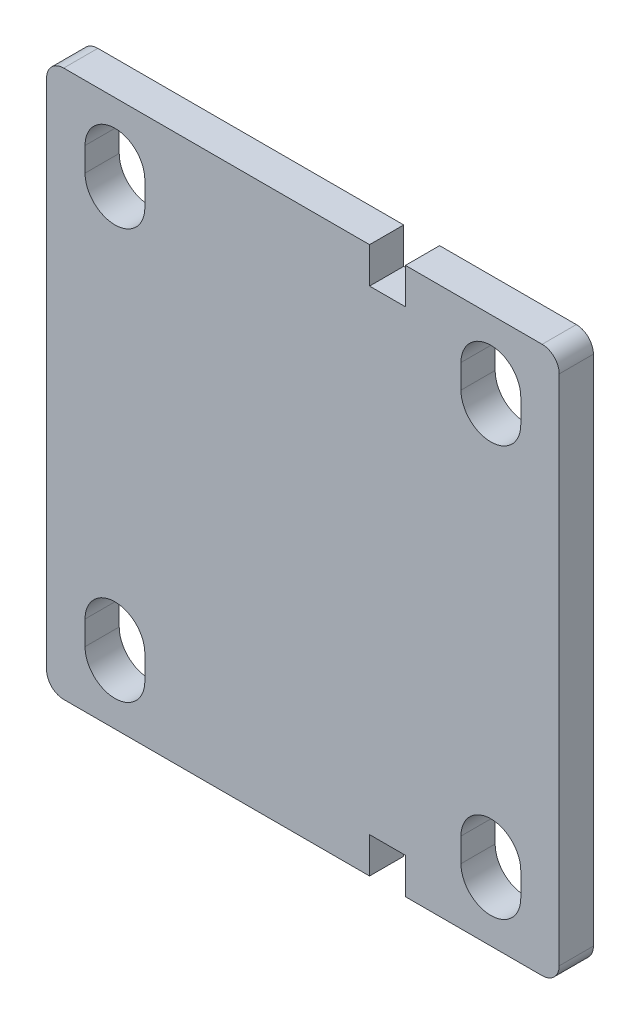
ISO-10303-21;
HEADER;
FILE_DESCRIPTION(('STEP AP214'),'2;1');
FILE_NAME('part.step','',(''),(''),'','','');
FILE_SCHEMA(('AUTOMOTIVE_DESIGN { 1 0 10303 214 1 1 1 1 }'));
ENDSEC;
DATA;
#1=APPLICATION_CONTEXT('core data for automotive mechanical design processes');
#2=APPLICATION_PROTOCOL_DEFINITION('international standard','automotive_design',2000,#1);
#3=PRODUCT_CONTEXT('',#1,'mechanical');
#4=PRODUCT('Part','Part','',(#3));
#5=PRODUCT_RELATED_PRODUCT_CATEGORY('part','',(#4));
#6=PRODUCT_DEFINITION_FORMATION('','',#4);
#7=PRODUCT_DEFINITION_CONTEXT('part definition',#1,'design');
#8=PRODUCT_DEFINITION('design','',#6,#7);
#9=PRODUCT_DEFINITION_SHAPE('','',#8);
#10=(LENGTH_UNIT() NAMED_UNIT(*) SI_UNIT(.MILLI.,.METRE.));
#11=(NAMED_UNIT(*) PLANE_ANGLE_UNIT() SI_UNIT($,.RADIAN.));
#12=(NAMED_UNIT(*) SI_UNIT($,.STERADIAN.) SOLID_ANGLE_UNIT());
#13=UNCERTAINTY_MEASURE_WITH_UNIT(LENGTH_MEASURE(1.E-05),#10,'distance_accuracy_value','');
#14=(GEOMETRIC_REPRESENTATION_CONTEXT(3) GLOBAL_UNCERTAINTY_ASSIGNED_CONTEXT((#13)) GLOBAL_UNIT_ASSIGNED_CONTEXT((#10,
#11,#12)) REPRESENTATION_CONTEXT('',''));
#15=CARTESIAN_POINT('',(0.,0.,0.));
#16=DIRECTION('',(0.,0.,1.));
#17=DIRECTION('',(1.,0.,0.));
#18=AXIS2_PLACEMENT_3D('',#15,#16,#17);
#19=CARTESIAN_POINT('',(150.,-80.,5.));
#20=DIRECTION('',(0.,1.,0.));
#21=DIRECTION('',(0.,0.,1.));
#22=AXIS2_PLACEMENT_3D('',#19,#20,#21);
#23=PLANE('',#22);
#24=DIRECTION('',(-1.,0.,0.));
#25=VECTOR('',#24,1.);
#26=CARTESIAN_POINT('',(150.,-80.,5.));
#27=LINE('',#26,#25);
#28=CARTESIAN_POINT('',(94.5,-80.,5.));
#29=VERTEX_POINT('',#28);
#30=CARTESIAN_POINT('',(5.,-80.,5.));
#31=VERTEX_POINT('',#30);
#32=EDGE_CURVE('E460',#29,#31,#27,.T.);
#33=ORIENTED_EDGE('',*,*,#32,.T.);
#34=DIRECTION('',(0.,0.,-1.));
#35=VECTOR('',#34,1.);
#36=CARTESIAN_POINT('',(5.,-80.,5.));
#37=LINE('',#36,#35);
#38=CARTESIAN_POINT('',(5.,-80.,-5.));
#39=VERTEX_POINT('',#38);
#40=EDGE_CURVE('E499',#31,#39,#37,.T.);
#41=ORIENTED_EDGE('',*,*,#40,.T.);
#42=DIRECTION('',(-1.,0.,0.));
#43=VECTOR('',#42,1.);
#44=CARTESIAN_POINT('',(150.,-80.,-5.));
#45=LINE('',#44,#43);
#46=CARTESIAN_POINT('',(94.5,-80.,-5.));
#47=VERTEX_POINT('',#46);
#48=EDGE_CURVE('E473',#47,#39,#45,.T.);
#49=ORIENTED_EDGE('',*,*,#48,.F.);
#50=DIRECTION('',(0.,0.,1.));
#51=VECTOR('',#50,1.);
#52=CARTESIAN_POINT('',(94.5,-80.,-5.));
#53=LINE('',#52,#51);
#54=EDGE_CURVE('E409',#47,#29,#53,.T.);
#55=ORIENTED_EDGE('',*,*,#54,.T.);
#56=EDGE_LOOP('',(#33,#41,#49,#55));
#57=FACE_BOUND('',#56,.T.);
#58=ADVANCED_FACE('F50',(#57),#23,.F.);
#59=CARTESIAN_POINT('',(150.,80.,5.));
#60=DIRECTION('',(0.,-1.,0.));
#61=DIRECTION('',(0.,0.,-1.));
#62=AXIS2_PLACEMENT_3D('',#59,#60,#61);
#63=PLANE('',#62);
#64=DIRECTION('',(-1.,0.,0.));
#65=VECTOR('',#64,1.);
#66=CARTESIAN_POINT('',(150.,80.,-5.));
#67=LINE('',#66,#65);
#68=CARTESIAN_POINT('',(94.5,80.,-5.));
#69=VERTEX_POINT('',#68);
#70=CARTESIAN_POINT('',(5.,80.,-5.));
#71=VERTEX_POINT('',#70);
#72=EDGE_CURVE('E470',#69,#71,#67,.T.);
#73=ORIENTED_EDGE('',*,*,#72,.T.);
#74=DIRECTION('',(0.,0.,1.));
#75=VECTOR('',#74,1.);
#76=CARTESIAN_POINT('',(5.,80.,5.));
#77=LINE('',#76,#75);
#78=CARTESIAN_POINT('',(5.,80.,5.));
#79=VERTEX_POINT('',#78);
#80=EDGE_CURVE('E476',#71,#79,#77,.T.);
#81=ORIENTED_EDGE('',*,*,#80,.T.);
#82=DIRECTION('',(-1.,0.,0.));
#83=VECTOR('',#82,1.);
#84=CARTESIAN_POINT('',(150.,80.,5.));
#85=LINE('',#84,#83);
#86=CARTESIAN_POINT('',(94.5,80.,5.));
#87=VERTEX_POINT('',#86);
#88=EDGE_CURVE('E467',#87,#79,#85,.T.);
#89=ORIENTED_EDGE('',*,*,#88,.F.);
#90=DIRECTION('',(0.,0.,1.));
#91=VECTOR('',#90,1.);
#92=CARTESIAN_POINT('',(94.5,80.,-5.));
#93=LINE('',#92,#91);
#94=EDGE_CURVE('E443',#69,#87,#93,.T.);
#95=ORIENTED_EDGE('',*,*,#94,.F.);
#96=EDGE_LOOP('',(#73,#81,#89,#95));
#97=FACE_BOUND('',#96,.T.);
#98=ADVANCED_FACE('F552',(#97),#63,.F.);
#99=CARTESIAN_POINT('',(145.,-80.,-5.));
#100=VERTEX_POINT('',#99);
#101=CARTESIAN_POINT('',(105.,-80.,-5.));
#102=VERTEX_POINT('',#101);
#103=EDGE_CURVE('E474',#100,#102,#45,.T.);
#104=ORIENTED_EDGE('',*,*,#103,.F.);
#105=DIRECTION('',(0.,0.,-1.));
#106=VECTOR('',#105,1.);
#107=CARTESIAN_POINT('',(145.,-80.,5.));
#108=LINE('',#107,#106);
#109=CARTESIAN_POINT('',(145.,-80.,5.));
#110=VERTEX_POINT('',#109);
#111=EDGE_CURVE('E58',#100,#110,#108,.F.);
#112=ORIENTED_EDGE('',*,*,#111,.T.);
#113=CARTESIAN_POINT('',(105.,-80.,5.));
#114=VERTEX_POINT('',#113);
#115=EDGE_CURVE('E465',#110,#114,#27,.T.);
#116=ORIENTED_EDGE('',*,*,#115,.T.);
#117=DIRECTION('',(0.,0.,1.));
#118=VECTOR('',#117,1.);
#119=CARTESIAN_POINT('',(105.,-80.,-5.));
#120=LINE('',#119,#118);
#121=EDGE_CURVE('E421',#102,#114,#120,.T.);
#122=ORIENTED_EDGE('',*,*,#121,.F.);
#123=EDGE_LOOP('',(#104,#112,#116,#122));
#124=FACE_BOUND('',#123,.T.);
#125=ADVANCED_FACE('F511',(#124),#23,.F.);
#126=CARTESIAN_POINT('',(150.,-80.,-5.));
#127=DIRECTION('',(0.,0.,1.));
#128=DIRECTION('',(1.,0.,0.));
#129=AXIS2_PLACEMENT_3D('',#126,#127,#128);
#130=PLANE('',#129);
#131=DIRECTION('',(0.,1.,0.));
#132=VECTOR('',#131,1.);
#133=CARTESIAN_POINT('',(0.,-80.,-5.));
#134=LINE('',#133,#132);
#135=CARTESIAN_POINT('',(0.,-75.,-5.));
#136=VERTEX_POINT('',#135);
#137=CARTESIAN_POINT('',(0.,75.,-5.));
#138=VERTEX_POINT('',#137);
#139=EDGE_CURVE('E445',#136,#138,#134,.T.);
#140=ORIENTED_EDGE('',*,*,#139,.T.);
#141=CARTESIAN_POINT('',(5.,75.,-5.));
#142=DIRECTION('',(0.,0.,1.));
#143=DIRECTION('',(1.,0.,0.));
#144=AXIS2_PLACEMENT_3D('',#141,#142,#143);
#145=CIRCLE('',#144,5.);
#146=EDGE_CURVE('E497',#138,#71,#145,.F.);
#147=ORIENTED_EDGE('',*,*,#146,.T.);
#148=ORIENTED_EDGE('',*,*,#72,.F.);
#149=DIRECTION('',(0.,-1.,0.));
#150=VECTOR('',#149,1.);
#151=CARTESIAN_POINT('',(94.5,80.,-5.));
#152=LINE('',#151,#150);
#153=CARTESIAN_POINT('',(94.5,69.5,-5.));
#154=VERTEX_POINT('',#153);
#155=EDGE_CURVE('E426',#69,#154,#152,.T.);
#156=ORIENTED_EDGE('',*,*,#155,.T.);
#157=DIRECTION('',(1.,0.,0.));
#158=VECTOR('',#157,1.);
#159=CARTESIAN_POINT('',(94.5,69.5,-5.));
#160=LINE('',#159,#158);
#161=CARTESIAN_POINT('',(105.,69.5,-5.));
#162=VERTEX_POINT('',#161);
#163=EDGE_CURVE('E429',#154,#162,#160,.T.);
#164=ORIENTED_EDGE('',*,*,#163,.T.);
#165=DIRECTION('',(0.,1.,0.));
#166=VECTOR('',#165,1.);
#167=CARTESIAN_POINT('',(105.,80.,-5.));
#168=LINE('',#167,#166);
#169=CARTESIAN_POINT('',(105.,80.,-5.));
#170=VERTEX_POINT('',#169);
#171=EDGE_CURVE('E433',#162,#170,#168,.T.);
#172=ORIENTED_EDGE('',*,*,#171,.T.);
#173=CARTESIAN_POINT('',(145.,80.,-5.));
#174=VERTEX_POINT('',#173);
#175=EDGE_CURVE('E471',#174,#170,#67,.T.);
#176=ORIENTED_EDGE('',*,*,#175,.F.);
#177=CARTESIAN_POINT('',(145.,75.,-5.));
#178=DIRECTION('',(0.,0.,1.));
#179=DIRECTION('',(1.,0.,0.));
#180=AXIS2_PLACEMENT_3D('',#177,#178,#179);
#181=CIRCLE('',#180,5.);
#182=CARTESIAN_POINT('',(150.,75.,-5.));
#183=VERTEX_POINT('',#182);
#184=EDGE_CURVE('E491',#174,#183,#181,.F.);
#185=ORIENTED_EDGE('',*,*,#184,.T.);
#186=DIRECTION('',(0.,1.,0.));
#187=VECTOR('',#186,1.);
#188=CARTESIAN_POINT('',(150.,-80.,-5.));
#189=LINE('',#188,#187);
#190=CARTESIAN_POINT('',(150.,-75.,-5.));
#191=VERTEX_POINT('',#190);
#192=EDGE_CURVE('E453',#191,#183,#189,.T.);
#193=ORIENTED_EDGE('',*,*,#192,.F.);
#194=CARTESIAN_POINT('',(145.,-75.,-5.));
#195=DIRECTION('',(0.,0.,1.));
#196=DIRECTION('',(1.,0.,0.));
#197=AXIS2_PLACEMENT_3D('',#194,#195,#196);
#198=CIRCLE('',#197,5.);
#199=EDGE_CURVE('E493',#191,#100,#198,.F.);
#200=ORIENTED_EDGE('',*,*,#199,.T.);
#201=ORIENTED_EDGE('',*,*,#103,.T.);
#202=DIRECTION('',(0.,1.,0.));
#203=VECTOR('',#202,1.);
#204=CARTESIAN_POINT('',(105.,-80.,-5.));
#205=LINE('',#204,#203);
#206=CARTESIAN_POINT('',(105.,-69.5,-5.));
#207=VERTEX_POINT('',#206);
#208=EDGE_CURVE('E402',#102,#207,#205,.T.);
#209=ORIENTED_EDGE('',*,*,#208,.T.);
#210=DIRECTION('',(-1.,0.,0.));
#211=VECTOR('',#210,1.);
#212=CARTESIAN_POINT('',(94.5,-69.5,-5.));
#213=LINE('',#212,#211);
#214=CARTESIAN_POINT('',(94.5,-69.5,-5.));
#215=VERTEX_POINT('',#214);
#216=EDGE_CURVE('E406',#207,#215,#213,.T.);
#217=ORIENTED_EDGE('',*,*,#216,.T.);
#218=DIRECTION('',(0.,-1.,0.));
#219=VECTOR('',#218,1.);
#220=CARTESIAN_POINT('',(94.5,-80.,-5.));
#221=LINE('',#220,#219);
#222=EDGE_CURVE('E399',#215,#47,#221,.T.);
#223=ORIENTED_EDGE('',*,*,#222,.T.);
#224=ORIENTED_EDGE('',*,*,#48,.T.);
#225=CARTESIAN_POINT('',(5.,-75.,-5.));
#226=DIRECTION('',(0.,0.,1.));
#227=DIRECTION('',(1.,0.,0.));
#228=AXIS2_PLACEMENT_3D('',#225,#226,#227);
#229=CIRCLE('',#228,5.);
#230=EDGE_CURVE('E495',#39,#136,#229,.F.);
#231=ORIENTED_EDGE('',*,*,#230,.T.);
#232=EDGE_LOOP('',(#140,#147,#148,#156,#164,#172,#176,#185,#193,#200,#201,#209,#217,#223,#224,#231));
#233=FACE_BOUND('',#232,.T.);
#234=CARTESIAN_POINT('',(130.,-63.5,-5.));
#235=DIRECTION('',(0.,0.,1.));
#236=DIRECTION('',(1.,0.,0.));
#237=AXIS2_PLACEMENT_3D('',#234,#235,#236);
#238=CIRCLE('',#237,8.74999999999999);
#239=CARTESIAN_POINT('',(121.25,-63.5,-5.));
#240=VERTEX_POINT('',#239);
#241=CARTESIAN_POINT('',(138.75,-63.5,-5.));
#242=VERTEX_POINT('',#241);
#243=EDGE_CURVE('E73',#240,#242,#238,.T.);
#244=ORIENTED_EDGE('',*,*,#243,.T.);
#245=DIRECTION('',(0.,1.,0.));
#246=VECTOR('',#245,1.);
#247=CARTESIAN_POINT('',(138.75,-56.5,-5.));
#248=LINE('',#247,#246);
#249=CARTESIAN_POINT('',(138.75,-56.5,-5.));
#250=VERTEX_POINT('',#249);
#251=EDGE_CURVE('E315',#242,#250,#248,.T.);
#252=ORIENTED_EDGE('',*,*,#251,.T.);
#253=CARTESIAN_POINT('',(130.,-56.5,-5.));
#254=DIRECTION('',(0.,0.,1.));
#255=DIRECTION('',(1.,0.,0.));
#256=AXIS2_PLACEMENT_3D('',#253,#254,#255);
#257=CIRCLE('',#256,8.74999999999999);
#258=CARTESIAN_POINT('',(121.25,-56.5,-5.));
#259=VERTEX_POINT('',#258);
#260=EDGE_CURVE('E307',#250,#259,#257,.T.);
#261=ORIENTED_EDGE('',*,*,#260,.T.);
#262=DIRECTION('',(0.,-1.,0.));
#263=VECTOR('',#262,1.);
#264=CARTESIAN_POINT('',(121.25,-56.5,-5.));
#265=LINE('',#264,#263);
#266=EDGE_CURVE('E310',#259,#240,#265,.T.);
#267=ORIENTED_EDGE('',*,*,#266,.T.);
#268=EDGE_LOOP('',(#244,#252,#261,#267));
#269=FACE_BOUND('',#268,.T.);
#270=CARTESIAN_POINT('',(130.,63.5,-5.));
#271=DIRECTION('',(0.,0.,1.));
#272=DIRECTION('',(-1.,0.,0.));
#273=AXIS2_PLACEMENT_3D('',#270,#271,#272);
#274=CIRCLE('',#273,8.74999999999999);
#275=CARTESIAN_POINT('',(138.75,63.5,-5.));
#276=VERTEX_POINT('',#275);
#277=CARTESIAN_POINT('',(121.25,63.5,-5.));
#278=VERTEX_POINT('',#277);
#279=EDGE_CURVE('E273',#276,#278,#274,.T.);
#280=ORIENTED_EDGE('',*,*,#279,.T.);
#281=DIRECTION('',(0.,-1.,0.));
#282=VECTOR('',#281,1.);
#283=CARTESIAN_POINT('',(121.25,56.5,-5.));
#284=LINE('',#283,#282);
#285=CARTESIAN_POINT('',(121.25,56.5,-5.));
#286=VERTEX_POINT('',#285);
#287=EDGE_CURVE('E283',#278,#286,#284,.T.);
#288=ORIENTED_EDGE('',*,*,#287,.T.);
#289=CARTESIAN_POINT('',(130.,56.5,-5.));
#290=DIRECTION('',(0.,0.,1.));
#291=DIRECTION('',(-1.,0.,0.));
#292=AXIS2_PLACEMENT_3D('',#289,#290,#291);
#293=CIRCLE('',#292,8.74999999999999);
#294=CARTESIAN_POINT('',(138.75,56.5,-5.));
#295=VERTEX_POINT('',#294);
#296=EDGE_CURVE('E274',#286,#295,#293,.T.);
#297=ORIENTED_EDGE('',*,*,#296,.T.);
#298=DIRECTION('',(0.,1.,0.));
#299=VECTOR('',#298,1.);
#300=CARTESIAN_POINT('',(138.75,56.5,-5.));
#301=LINE('',#300,#299);
#302=EDGE_CURVE('E263',#295,#276,#301,.T.);
#303=ORIENTED_EDGE('',*,*,#302,.T.);
#304=EDGE_LOOP('',(#280,#288,#297,#303));
#305=FACE_BOUND('',#304,.T.);
#306=CARTESIAN_POINT('',(20.,63.5,-5.));
#307=DIRECTION('',(0.,0.,1.));
#308=DIRECTION('',(1.,0.,0.));
#309=AXIS2_PLACEMENT_3D('',#306,#307,#308);
#310=CIRCLE('',#309,8.74999999999999);
#311=CARTESIAN_POINT('',(28.75,63.5,-5.));
#312=VERTEX_POINT('',#311);
#313=CARTESIAN_POINT('',(11.25,63.5,-5.));
#314=VERTEX_POINT('',#313);
#315=EDGE_CURVE('E373',#312,#314,#310,.T.);
#316=ORIENTED_EDGE('',*,*,#315,.T.);
#317=DIRECTION('',(0.,-1.,0.));
#318=VECTOR('',#317,1.);
#319=CARTESIAN_POINT('',(11.25,56.5,-5.));
#320=LINE('',#319,#318);
#321=CARTESIAN_POINT('',(11.25,56.5,-5.));
#322=VERTEX_POINT('',#321);
#323=EDGE_CURVE('E376',#314,#322,#320,.T.);
#324=ORIENTED_EDGE('',*,*,#323,.T.);
#325=CARTESIAN_POINT('',(20.,56.5,-5.));
#326=DIRECTION('',(0.,0.,1.));
#327=DIRECTION('',(1.,0.,0.));
#328=AXIS2_PLACEMENT_3D('',#325,#326,#327);
#329=CIRCLE('',#328,8.74999999999999);
#330=CARTESIAN_POINT('',(28.75,56.5,-5.));
#331=VERTEX_POINT('',#330);
#332=EDGE_CURVE('E366',#322,#331,#329,.T.);
#333=ORIENTED_EDGE('',*,*,#332,.T.);
#334=DIRECTION('',(0.,1.,0.));
#335=VECTOR('',#334,1.);
#336=CARTESIAN_POINT('',(28.75,56.5,-5.));
#337=LINE('',#336,#335);
#338=EDGE_CURVE('E369',#331,#312,#337,.T.);
#339=ORIENTED_EDGE('',*,*,#338,.T.);
#340=EDGE_LOOP('',(#316,#324,#333,#339));
#341=FACE_BOUND('',#340,.T.);
#342=CARTESIAN_POINT('',(20.,-63.5,-5.));
#343=DIRECTION('',(0.,0.,1.));
#344=DIRECTION('',(-1.,0.,0.));
#345=AXIS2_PLACEMENT_3D('',#342,#343,#344);
#346=CIRCLE('',#345,8.74999999999999);
#347=CARTESIAN_POINT('',(11.25,-63.5,-5.));
#348=VERTEX_POINT('',#347);
#349=CARTESIAN_POINT('',(28.75,-63.5,-5.));
#350=VERTEX_POINT('',#349);
#351=EDGE_CURVE('E65',#348,#350,#346,.T.);
#352=ORIENTED_EDGE('',*,*,#351,.T.);
#353=DIRECTION('',(0.,1.,0.));
#354=VECTOR('',#353,1.);
#355=CARTESIAN_POINT('',(28.75,-56.5,-5.));
#356=LINE('',#355,#354);
#357=CARTESIAN_POINT('',(28.75,-56.5,-5.));
#358=VERTEX_POINT('',#357);
#359=EDGE_CURVE('E345',#350,#358,#356,.T.);
#360=ORIENTED_EDGE('',*,*,#359,.T.);
#361=CARTESIAN_POINT('',(20.,-56.5,-5.));
#362=DIRECTION('',(0.,0.,1.));
#363=DIRECTION('',(-1.,0.,0.));
#364=AXIS2_PLACEMENT_3D('',#361,#362,#363);
#365=CIRCLE('',#364,8.74999999999999);
#366=CARTESIAN_POINT('',(11.25,-56.5,-5.));
#367=VERTEX_POINT('',#366);
#368=EDGE_CURVE('E337',#358,#367,#365,.T.);
#369=ORIENTED_EDGE('',*,*,#368,.T.);
#370=DIRECTION('',(0.,-1.,0.));
#371=VECTOR('',#370,1.);
#372=CARTESIAN_POINT('',(11.25,-56.5,-5.));
#373=LINE('',#372,#371);
#374=EDGE_CURVE('E340',#367,#348,#373,.T.);
#375=ORIENTED_EDGE('',*,*,#374,.T.);
#376=EDGE_LOOP('',(#352,#360,#369,#375));
#377=FACE_BOUND('',#376,.T.);
#378=ADVANCED_FACE('F285',(#233,#269,#305,#341,#377),#130,.F.);
#379=CARTESIAN_POINT('',(145.,80.,5.));
#380=VERTEX_POINT('',#379);
#381=CARTESIAN_POINT('',(105.,80.,5.));
#382=VERTEX_POINT('',#381);
#383=EDGE_CURVE('E468',#380,#382,#85,.T.);
#384=ORIENTED_EDGE('',*,*,#383,.F.);
#385=DIRECTION('',(0.,0.,1.));
#386=VECTOR('',#385,1.);
#387=CARTESIAN_POINT('',(145.,80.,-5.));
#388=LINE('',#387,#386);
#389=EDGE_CURVE('E12',#380,#174,#388,.F.);
#390=ORIENTED_EDGE('',*,*,#389,.T.);
#391=ORIENTED_EDGE('',*,*,#175,.T.);
#392=DIRECTION('',(0.,0.,1.));
#393=VECTOR('',#392,1.);
#394=CARTESIAN_POINT('',(105.,80.,-5.));
#395=LINE('',#394,#393);
#396=EDGE_CURVE('E446',#170,#382,#395,.T.);
#397=ORIENTED_EDGE('',*,*,#396,.T.);
#398=EDGE_LOOP('',(#384,#390,#391,#397));
#399=FACE_BOUND('',#398,.T.);
#400=ADVANCED_FACE('F536',(#399),#63,.F.);
#401=CARTESIAN_POINT('',(150.,-80.,5.));
#402=DIRECTION('',(0.,0.,-1.));
#403=DIRECTION('',(-1.,0.,0.));
#404=AXIS2_PLACEMENT_3D('',#401,#402,#403);
#405=PLANE('',#404);
#406=DIRECTION('',(0.,-1.,0.));
#407=VECTOR('',#406,1.);
#408=CARTESIAN_POINT('',(121.25,-56.5,5.));
#409=LINE('',#408,#407);
#410=CARTESIAN_POINT('',(121.25,-56.5,5.));
#411=VERTEX_POINT('',#410);
#412=CARTESIAN_POINT('',(121.25,-63.5,5.));
#413=VERTEX_POINT('',#412);
#414=EDGE_CURVE('E322',#411,#413,#409,.T.);
#415=ORIENTED_EDGE('',*,*,#414,.F.);
#416=CARTESIAN_POINT('',(130.,-56.5,5.));
#417=DIRECTION('',(0.,0.,1.));
#418=DIRECTION('',(1.,0.,0.));
#419=AXIS2_PLACEMENT_3D('',#416,#417,#418);
#420=CIRCLE('',#419,8.74999999999999);
#421=CARTESIAN_POINT('',(138.75,-56.5,5.));
#422=VERTEX_POINT('',#421);
#423=EDGE_CURVE('E319',#422,#411,#420,.T.);
#424=ORIENTED_EDGE('',*,*,#423,.F.);
#425=DIRECTION('',(0.,1.,0.));
#426=VECTOR('',#425,1.);
#427=CARTESIAN_POINT('',(138.75,-56.5,5.));
#428=LINE('',#427,#426);
#429=CARTESIAN_POINT('',(138.75,-63.5,5.));
#430=VERTEX_POINT('',#429);
#431=EDGE_CURVE('E311',#430,#422,#428,.T.);
#432=ORIENTED_EDGE('',*,*,#431,.F.);
#433=CARTESIAN_POINT('',(130.,-63.5,5.));
#434=DIRECTION('',(0.,0.,1.));
#435=DIRECTION('',(1.,0.,0.));
#436=AXIS2_PLACEMENT_3D('',#433,#434,#435);
#437=CIRCLE('',#436,8.74999999999999);
#438=EDGE_CURVE('E325',#413,#430,#437,.T.);
#439=ORIENTED_EDGE('',*,*,#438,.F.);
#440=EDGE_LOOP('',(#415,#424,#432,#439));
#441=FACE_BOUND('',#440,.T.);
#442=DIRECTION('',(0.,1.,0.));
#443=VECTOR('',#442,1.);
#444=CARTESIAN_POINT('',(138.75,56.5,5.));
#445=LINE('',#444,#443);
#446=CARTESIAN_POINT('',(138.75,56.5,5.));
#447=VERTEX_POINT('',#446);
#448=CARTESIAN_POINT('',(138.75,63.5,5.));
#449=VERTEX_POINT('',#448);
#450=EDGE_CURVE('E295',#447,#449,#445,.T.);
#451=ORIENTED_EDGE('',*,*,#450,.F.);
#452=CARTESIAN_POINT('',(130.,56.5,5.));
#453=DIRECTION('',(0.,0.,1.));
#454=DIRECTION('',(-1.,0.,0.));
#455=AXIS2_PLACEMENT_3D('',#452,#453,#454);
#456=CIRCLE('',#455,8.74999999999999);
#457=CARTESIAN_POINT('',(121.25,56.5,5.));
#458=VERTEX_POINT('',#457);
#459=EDGE_CURVE('E282',#458,#447,#456,.T.);
#460=ORIENTED_EDGE('',*,*,#459,.F.);
#461=DIRECTION('',(0.,-1.,0.));
#462=VECTOR('',#461,1.);
#463=CARTESIAN_POINT('',(121.25,56.5,5.));
#464=LINE('',#463,#462);
#465=CARTESIAN_POINT('',(121.25,63.5,5.));
#466=VERTEX_POINT('',#465);
#467=EDGE_CURVE('E287',#466,#458,#464,.T.);
#468=ORIENTED_EDGE('',*,*,#467,.F.);
#469=CARTESIAN_POINT('',(130.,63.5,5.));
#470=DIRECTION('',(0.,0.,1.));
#471=DIRECTION('',(-1.,0.,0.));
#472=AXIS2_PLACEMENT_3D('',#469,#470,#471);
#473=CIRCLE('',#472,8.74999999999999);
#474=EDGE_CURVE('E289',#449,#466,#473,.T.);
#475=ORIENTED_EDGE('',*,*,#474,.F.);
#476=EDGE_LOOP('',(#451,#460,#468,#475));
#477=FACE_BOUND('',#476,.T.);
#478=DIRECTION('',(0.,1.,0.));
#479=VECTOR('',#478,1.);
#480=CARTESIAN_POINT('',(28.75,56.5,5.));
#481=LINE('',#480,#479);
#482=CARTESIAN_POINT('',(28.75,56.5,5.));
#483=VERTEX_POINT('',#482);
#484=CARTESIAN_POINT('',(28.75,63.5,5.));
#485=VERTEX_POINT('',#484);
#486=EDGE_CURVE('E381',#483,#485,#481,.T.);
#487=ORIENTED_EDGE('',*,*,#486,.F.);
#488=CARTESIAN_POINT('',(20.,56.5,5.));
#489=DIRECTION('',(0.,0.,1.));
#490=DIRECTION('',(1.,0.,0.));
#491=AXIS2_PLACEMENT_3D('',#488,#489,#490);
#492=CIRCLE('',#491,8.74999999999999);
#493=CARTESIAN_POINT('',(11.25,56.5,5.));
#494=VERTEX_POINT('',#493);
#495=EDGE_CURVE('E302',#494,#483,#492,.T.);
#496=ORIENTED_EDGE('',*,*,#495,.F.);
#497=DIRECTION('',(0.,-1.,0.));
#498=VECTOR('',#497,1.);
#499=CARTESIAN_POINT('',(11.25,56.5,5.));
#500=LINE('',#499,#498);
#501=CARTESIAN_POINT('',(11.25,63.5,5.));
#502=VERTEX_POINT('',#501);
#503=EDGE_CURVE('E370',#502,#494,#500,.T.);
#504=ORIENTED_EDGE('',*,*,#503,.F.);
#505=CARTESIAN_POINT('',(20.,63.5,5.));
#506=DIRECTION('',(0.,0.,1.));
#507=DIRECTION('',(1.,0.,0.));
#508=AXIS2_PLACEMENT_3D('',#505,#506,#507);
#509=CIRCLE('',#508,8.74999999999999);
#510=EDGE_CURVE('E383',#485,#502,#509,.T.);
#511=ORIENTED_EDGE('',*,*,#510,.F.);
#512=EDGE_LOOP('',(#487,#496,#504,#511));
#513=FACE_BOUND('',#512,.T.);
#514=DIRECTION('',(0.,-1.,0.));
#515=VECTOR('',#514,1.);
#516=CARTESIAN_POINT('',(11.25,-56.5,5.));
#517=LINE('',#516,#515);
#518=CARTESIAN_POINT('',(11.25,-56.5,5.));
#519=VERTEX_POINT('',#518);
#520=CARTESIAN_POINT('',(11.25,-63.5,5.));
#521=VERTEX_POINT('',#520);
#522=EDGE_CURVE('E352',#519,#521,#517,.T.);
#523=ORIENTED_EDGE('',*,*,#522,.F.);
#524=CARTESIAN_POINT('',(20.,-56.5,5.));
#525=DIRECTION('',(0.,0.,1.));
#526=DIRECTION('',(-1.,0.,0.));
#527=AXIS2_PLACEMENT_3D('',#524,#525,#526);
#528=CIRCLE('',#527,8.74999999999999);
#529=CARTESIAN_POINT('',(28.75,-56.5,5.));
#530=VERTEX_POINT('',#529);
#531=EDGE_CURVE('E349',#530,#519,#528,.T.);
#532=ORIENTED_EDGE('',*,*,#531,.F.);
#533=DIRECTION('',(0.,1.,0.));
#534=VECTOR('',#533,1.);
#535=CARTESIAN_POINT('',(28.75,-56.5,5.));
#536=LINE('',#535,#534);
#537=CARTESIAN_POINT('',(28.75,-63.5,5.));
#538=VERTEX_POINT('',#537);
#539=EDGE_CURVE('E341',#538,#530,#536,.T.);
#540=ORIENTED_EDGE('',*,*,#539,.F.);
#541=CARTESIAN_POINT('',(20.,-63.5,5.));
#542=DIRECTION('',(0.,0.,1.));
#543=DIRECTION('',(-1.,0.,0.));
#544=AXIS2_PLACEMENT_3D('',#541,#542,#543);
#545=CIRCLE('',#544,8.74999999999999);
#546=EDGE_CURVE('E354',#521,#538,#545,.T.);
#547=ORIENTED_EDGE('',*,*,#546,.F.);
#548=EDGE_LOOP('',(#523,#532,#540,#547));
#549=FACE_BOUND('',#548,.T.);
#550=ORIENTED_EDGE('',*,*,#88,.T.);
#551=CARTESIAN_POINT('',(5.,75.,5.));
#552=DIRECTION('',(0.,0.,-1.));
#553=DIRECTION('',(-1.,0.,0.));
#554=AXIS2_PLACEMENT_3D('',#551,#552,#553);
#555=CIRCLE('',#554,5.);
#556=CARTESIAN_POINT('',(0.,75.,5.));
#557=VERTEX_POINT('',#556);
#558=EDGE_CURVE('E485',#79,#557,#555,.F.);
#559=ORIENTED_EDGE('',*,*,#558,.T.);
#560=DIRECTION('',(0.,-1.,0.));
#561=VECTOR('',#560,1.);
#562=CARTESIAN_POINT('',(0.,-80.,5.));
#563=LINE('',#562,#561);
#564=CARTESIAN_POINT('',(0.,-75.,5.));
#565=VERTEX_POINT('',#564);
#566=EDGE_CURVE('E457',#557,#565,#563,.T.);
#567=ORIENTED_EDGE('',*,*,#566,.T.);
#568=CARTESIAN_POINT('',(5.,-75.,5.));
#569=DIRECTION('',(0.,0.,-1.));
#570=DIRECTION('',(-1.,0.,0.));
#571=AXIS2_PLACEMENT_3D('',#568,#569,#570);
#572=CIRCLE('',#571,5.);
#573=EDGE_CURVE('E483',#565,#31,#572,.F.);
#574=ORIENTED_EDGE('',*,*,#573,.T.);
#575=ORIENTED_EDGE('',*,*,#32,.F.);
#576=DIRECTION('',(0.,-1.,0.));
#577=VECTOR('',#576,1.);
#578=CARTESIAN_POINT('',(94.5,-80.,5.));
#579=LINE('',#578,#577);
#580=CARTESIAN_POINT('',(94.5,-69.5,5.));
#581=VERTEX_POINT('',#580);
#582=EDGE_CURVE('E390',#581,#29,#579,.T.);
#583=ORIENTED_EDGE('',*,*,#582,.F.);
#584=DIRECTION('',(-1.,0.,0.));
#585=VECTOR('',#584,1.);
#586=CARTESIAN_POINT('',(94.5,-69.5,5.));
#587=LINE('',#586,#585);
#588=CARTESIAN_POINT('',(105.,-69.5,5.));
#589=VERTEX_POINT('',#588);
#590=EDGE_CURVE('E403',#589,#581,#587,.T.);
#591=ORIENTED_EDGE('',*,*,#590,.F.);
#592=DIRECTION('',(0.,1.,0.));
#593=VECTOR('',#592,1.);
#594=CARTESIAN_POINT('',(105.,-80.,5.));
#595=LINE('',#594,#593);
#596=EDGE_CURVE('E411',#114,#589,#595,.T.);
#597=ORIENTED_EDGE('',*,*,#596,.F.);
#598=ORIENTED_EDGE('',*,*,#115,.F.);
#599=CARTESIAN_POINT('',(145.,-75.,5.));
#600=DIRECTION('',(0.,0.,-1.));
#601=DIRECTION('',(-1.,0.,0.));
#602=AXIS2_PLACEMENT_3D('',#599,#600,#601);
#603=CIRCLE('',#602,5.);
#604=CARTESIAN_POINT('',(150.,-75.,5.));
#605=VERTEX_POINT('',#604);
#606=EDGE_CURVE('E481',#110,#605,#603,.F.);
#607=ORIENTED_EDGE('',*,*,#606,.T.);
#608=DIRECTION('',(0.,-1.,0.));
#609=VECTOR('',#608,1.);
#610=CARTESIAN_POINT('',(150.,-80.,5.));
#611=LINE('',#610,#609);
#612=CARTESIAN_POINT('',(150.,75.,5.));
#613=VERTEX_POINT('',#612);
#614=EDGE_CURVE('E456',#613,#605,#611,.T.);
#615=ORIENTED_EDGE('',*,*,#614,.F.);
#616=CARTESIAN_POINT('',(145.,75.,5.));
#617=DIRECTION('',(0.,0.,-1.));
#618=DIRECTION('',(-1.,0.,0.));
#619=AXIS2_PLACEMENT_3D('',#616,#617,#618);
#620=CIRCLE('',#619,5.);
#621=EDGE_CURVE('E479',#613,#380,#620,.F.);
#622=ORIENTED_EDGE('',*,*,#621,.T.);
#623=ORIENTED_EDGE('',*,*,#383,.T.);
#624=DIRECTION('',(0.,1.,0.));
#625=VECTOR('',#624,1.);
#626=CARTESIAN_POINT('',(105.,80.,5.));
#627=LINE('',#626,#625);
#628=CARTESIAN_POINT('',(105.,69.5,5.));
#629=VERTEX_POINT('',#628);
#630=EDGE_CURVE('E430',#629,#382,#627,.T.);
#631=ORIENTED_EDGE('',*,*,#630,.F.);
#632=DIRECTION('',(1.,0.,0.));
#633=VECTOR('',#632,1.);
#634=CARTESIAN_POINT('',(94.5,69.5,5.));
#635=LINE('',#634,#633);
#636=CARTESIAN_POINT('',(94.5,69.5,5.));
#637=VERTEX_POINT('',#636);
#638=EDGE_CURVE('E438',#637,#629,#635,.T.);
#639=ORIENTED_EDGE('',*,*,#638,.F.);
#640=DIRECTION('',(0.,-1.,0.));
#641=VECTOR('',#640,1.);
#642=CARTESIAN_POINT('',(94.5,80.,5.));
#643=LINE('',#642,#641);
#644=EDGE_CURVE('E418',#87,#637,#643,.T.);
#645=ORIENTED_EDGE('',*,*,#644,.F.);
#646=EDGE_LOOP('',(#550,#559,#567,#574,#575,#583,#591,#597,#598,#607,#615,#622,#623,#631,#639,#645));
#647=FACE_BOUND('',#646,.T.);
#648=ADVANCED_FACE('F518',(#441,#477,#513,#549,#647),#405,.F.);
#649=CARTESIAN_POINT('',(150.,-80.,-5.));
#650=DIRECTION('',(1.,0.,0.));
#651=DIRECTION('',(0.,0.,-1.));
#652=AXIS2_PLACEMENT_3D('',#649,#650,#651);
#653=PLANE('',#652);
#654=ORIENTED_EDGE('',*,*,#614,.T.);
#655=DIRECTION('',(0.,0.,-1.));
#656=VECTOR('',#655,1.);
#657=CARTESIAN_POINT('',(150.,-75.,-5.));
#658=LINE('',#657,#656);
#659=EDGE_CURVE('E505',#605,#191,#658,.T.);
#660=ORIENTED_EDGE('',*,*,#659,.T.);
#661=ORIENTED_EDGE('',*,*,#192,.T.);
#662=DIRECTION('',(0.,0.,1.));
#663=VECTOR('',#662,1.);
#664=CARTESIAN_POINT('',(150.,75.,5.));
#665=LINE('',#664,#663);
#666=EDGE_CURVE('E502',#183,#613,#665,.T.);
#667=ORIENTED_EDGE('',*,*,#666,.T.);
#668=EDGE_LOOP('',(#654,#660,#661,#667));
#669=FACE_BOUND('',#668,.T.);
#670=ADVANCED_FACE('F525',(#669),#653,.T.);
#671=CARTESIAN_POINT('',(0.,-80.,-5.));
#672=DIRECTION('',(1.,0.,0.));
#673=DIRECTION('',(0.,0.,-1.));
#674=AXIS2_PLACEMENT_3D('',#671,#672,#673);
#675=PLANE('',#674);
#676=ORIENTED_EDGE('',*,*,#566,.F.);
#677=DIRECTION('',(0.,0.,1.));
#678=VECTOR('',#677,1.);
#679=CARTESIAN_POINT('',(0.,75.,-5.));
#680=LINE('',#679,#678);
#681=EDGE_CURVE('E489',#557,#138,#680,.F.);
#682=ORIENTED_EDGE('',*,*,#681,.T.);
#683=ORIENTED_EDGE('',*,*,#139,.F.);
#684=DIRECTION('',(0.,0.,-1.));
#685=VECTOR('',#684,1.);
#686=CARTESIAN_POINT('',(0.,-75.,-5.));
#687=LINE('',#686,#685);
#688=EDGE_CURVE('E487',#136,#565,#687,.F.);
#689=ORIENTED_EDGE('',*,*,#688,.T.);
#690=EDGE_LOOP('',(#676,#682,#683,#689));
#691=FACE_BOUND('',#690,.T.);
#692=ADVANCED_FACE('F561',(#691),#675,.F.);
#693=CARTESIAN_POINT('',(94.5,80.,-5.));
#694=DIRECTION('',(-1.,0.,0.));
#695=DIRECTION('',(0.,0.,1.));
#696=AXIS2_PLACEMENT_3D('',#693,#694,#695);
#697=PLANE('',#696);
#698=ORIENTED_EDGE('',*,*,#644,.T.);
#699=DIRECTION('',(0.,0.,1.));
#700=VECTOR('',#699,1.);
#701=CARTESIAN_POINT('',(94.5,69.5,-5.));
#702=LINE('',#701,#700);
#703=EDGE_CURVE('E436',#154,#637,#702,.T.);
#704=ORIENTED_EDGE('',*,*,#703,.F.);
#705=ORIENTED_EDGE('',*,*,#155,.F.);
#706=ORIENTED_EDGE('',*,*,#94,.T.);
#707=EDGE_LOOP('',(#698,#704,#705,#706));
#708=FACE_BOUND('',#707,.T.);
#709=ADVANCED_FACE('F611',(#708),#697,.F.);
#710=CARTESIAN_POINT('',(105.,80.,-5.));
#711=DIRECTION('',(1.,0.,0.));
#712=DIRECTION('',(0.,0.,-1.));
#713=AXIS2_PLACEMENT_3D('',#710,#711,#712);
#714=PLANE('',#713);
#715=ORIENTED_EDGE('',*,*,#630,.T.);
#716=ORIENTED_EDGE('',*,*,#396,.F.);
#717=ORIENTED_EDGE('',*,*,#171,.F.);
#718=DIRECTION('',(0.,0.,1.));
#719=VECTOR('',#718,1.);
#720=CARTESIAN_POINT('',(105.,69.5,-5.));
#721=LINE('',#720,#719);
#722=EDGE_CURVE('E449',#162,#629,#721,.T.);
#723=ORIENTED_EDGE('',*,*,#722,.T.);
#724=EDGE_LOOP('',(#715,#716,#717,#723));
#725=FACE_BOUND('',#724,.T.);
#726=ADVANCED_FACE('F540',(#725),#714,.F.);
#727=CARTESIAN_POINT('',(94.5,69.5,-5.));
#728=DIRECTION('',(0.,-1.,0.));
#729=DIRECTION('',(0.,0.,-1.));
#730=AXIS2_PLACEMENT_3D('',#727,#728,#729);
#731=PLANE('',#730);
#732=ORIENTED_EDGE('',*,*,#638,.T.);
#733=ORIENTED_EDGE('',*,*,#722,.F.);
#734=ORIENTED_EDGE('',*,*,#163,.F.);
#735=ORIENTED_EDGE('',*,*,#703,.T.);
#736=EDGE_LOOP('',(#732,#733,#734,#735));
#737=FACE_BOUND('',#736,.T.);
#738=ADVANCED_FACE('F544',(#737),#731,.F.);
#739=CARTESIAN_POINT('',(94.5,-80.,-5.));
#740=DIRECTION('',(-1.,0.,0.));
#741=DIRECTION('',(0.,-1.,0.));
#742=AXIS2_PLACEMENT_3D('',#739,#740,#741);
#743=PLANE('',#742);
#744=ORIENTED_EDGE('',*,*,#582,.T.);
#745=ORIENTED_EDGE('',*,*,#54,.F.);
#746=ORIENTED_EDGE('',*,*,#222,.F.);
#747=DIRECTION('',(0.,0.,1.));
#748=VECTOR('',#747,1.);
#749=CARTESIAN_POINT('',(94.5,-69.5,-5.));
#750=LINE('',#749,#748);
#751=EDGE_CURVE('E416',#215,#581,#750,.T.);
#752=ORIENTED_EDGE('',*,*,#751,.T.);
#753=EDGE_LOOP('',(#744,#745,#746,#752));
#754=FACE_BOUND('',#753,.T.);
#755=ADVANCED_FACE('F575',(#754),#743,.F.);
#756=CARTESIAN_POINT('',(94.5,-69.5,-5.));
#757=DIRECTION('',(0.,1.,0.));
#758=DIRECTION('',(0.,0.,1.));
#759=AXIS2_PLACEMENT_3D('',#756,#757,#758);
#760=PLANE('',#759);
#761=ORIENTED_EDGE('',*,*,#590,.T.);
#762=ORIENTED_EDGE('',*,*,#751,.F.);
#763=ORIENTED_EDGE('',*,*,#216,.F.);
#764=DIRECTION('',(0.,0.,1.));
#765=VECTOR('',#764,1.);
#766=CARTESIAN_POINT('',(105.,-69.5,-5.));
#767=LINE('',#766,#765);
#768=EDGE_CURVE('E419',#207,#589,#767,.T.);
#769=ORIENTED_EDGE('',*,*,#768,.T.);
#770=EDGE_LOOP('',(#761,#762,#763,#769));
#771=FACE_BOUND('',#770,.T.);
#772=ADVANCED_FACE('F579',(#771),#760,.F.);
#773=CARTESIAN_POINT('',(105.,-80.,-5.));
#774=DIRECTION('',(1.,0.,0.));
#775=DIRECTION('',(0.,0.,-1.));
#776=AXIS2_PLACEMENT_3D('',#773,#774,#775);
#777=PLANE('',#776);
#778=ORIENTED_EDGE('',*,*,#596,.T.);
#779=ORIENTED_EDGE('',*,*,#768,.F.);
#780=ORIENTED_EDGE('',*,*,#208,.F.);
#781=ORIENTED_EDGE('',*,*,#121,.T.);
#782=EDGE_LOOP('',(#778,#779,#780,#781));
#783=FACE_BOUND('',#782,.T.);
#784=ADVANCED_FACE('F581',(#783),#777,.F.);
#785=CARTESIAN_POINT('',(5.,75.,5.));
#786=DIRECTION('',(0.,0.,1.));
#787=DIRECTION('',(1.,0.,0.));
#788=AXIS2_PLACEMENT_3D('',#785,#786,#787);
#789=CYLINDRICAL_SURFACE('',#788,5.);
#790=ORIENTED_EDGE('',*,*,#146,.F.);
#791=ORIENTED_EDGE('',*,*,#681,.F.);
#792=ORIENTED_EDGE('',*,*,#558,.F.);
#793=ORIENTED_EDGE('',*,*,#80,.F.);
#794=EDGE_LOOP('',(#790,#791,#792,#793));
#795=FACE_BOUND('',#794,.T.);
#796=ADVANCED_FACE('F556',(#795),#789,.T.);
#797=CARTESIAN_POINT('',(5.,-75.,5.));
#798=DIRECTION('',(0.,0.,-1.));
#799=DIRECTION('',(-1.,0.,0.));
#800=AXIS2_PLACEMENT_3D('',#797,#798,#799);
#801=CYLINDRICAL_SURFACE('',#800,5.);
#802=ORIENTED_EDGE('',*,*,#573,.F.);
#803=ORIENTED_EDGE('',*,*,#688,.F.);
#804=ORIENTED_EDGE('',*,*,#230,.F.);
#805=ORIENTED_EDGE('',*,*,#40,.F.);
#806=EDGE_LOOP('',(#802,#803,#804,#805));
#807=FACE_BOUND('',#806,.T.);
#808=ADVANCED_FACE('F565',(#807),#801,.T.);
#809=CARTESIAN_POINT('',(145.,-75.,-5.));
#810=DIRECTION('',(0.,0.,1.));
#811=DIRECTION('',(1.,0.,0.));
#812=AXIS2_PLACEMENT_3D('',#809,#810,#811);
#813=CYLINDRICAL_SURFACE('',#812,5.);
#814=ORIENTED_EDGE('',*,*,#606,.F.);
#815=ORIENTED_EDGE('',*,*,#111,.F.);
#816=ORIENTED_EDGE('',*,*,#199,.F.);
#817=ORIENTED_EDGE('',*,*,#659,.F.);
#818=EDGE_LOOP('',(#814,#815,#816,#817));
#819=FACE_BOUND('',#818,.T.);
#820=ADVANCED_FACE('F522',(#819),#813,.T.);
#821=CARTESIAN_POINT('',(145.,75.,-5.));
#822=DIRECTION('',(0.,0.,-1.));
#823=DIRECTION('',(-1.,0.,0.));
#824=AXIS2_PLACEMENT_3D('',#821,#822,#823);
#825=CYLINDRICAL_SURFACE('',#824,5.);
#826=ORIENTED_EDGE('',*,*,#184,.F.);
#827=ORIENTED_EDGE('',*,*,#389,.F.);
#828=ORIENTED_EDGE('',*,*,#621,.F.);
#829=ORIENTED_EDGE('',*,*,#666,.F.);
#830=EDGE_LOOP('',(#826,#827,#828,#829));
#831=FACE_BOUND('',#830,.T.);
#832=ADVANCED_FACE('F52',(#831),#825,.T.);
#833=CARTESIAN_POINT('',(11.25,56.5,-5.));
#834=DIRECTION('',(-1.,0.,0.));
#835=DIRECTION('',(0.,-1.,0.));
#836=AXIS2_PLACEMENT_3D('',#833,#834,#835);
#837=PLANE('',#836);
#838=ORIENTED_EDGE('',*,*,#503,.T.);
#839=DIRECTION('',(0.,0.,1.));
#840=VECTOR('',#839,1.);
#841=CARTESIAN_POINT('',(11.25,56.5,-5.));
#842=LINE('',#841,#840);
#843=EDGE_CURVE('E387',#322,#494,#842,.T.);
#844=ORIENTED_EDGE('',*,*,#843,.F.);
#845=ORIENTED_EDGE('',*,*,#323,.F.);
#846=DIRECTION('',(0.,0.,1.));
#847=VECTOR('',#846,1.);
#848=CARTESIAN_POINT('',(11.25,63.5,-5.));
#849=LINE('',#848,#847);
#850=EDGE_CURVE('E391',#314,#502,#849,.T.);
#851=ORIENTED_EDGE('',*,*,#850,.T.);
#852=EDGE_LOOP('',(#838,#844,#845,#851));
#853=FACE_BOUND('',#852,.T.);
#854=ADVANCED_FACE('F699',(#853),#837,.F.);
#855=CARTESIAN_POINT('',(28.75,56.5,-5.));
#856=DIRECTION('',(1.,0.,0.));
#857=DIRECTION('',(0.,0.,-1.));
#858=AXIS2_PLACEMENT_3D('',#855,#856,#857);
#859=PLANE('',#858);
#860=ORIENTED_EDGE('',*,*,#486,.T.);
#861=DIRECTION('',(0.,0.,1.));
#862=VECTOR('',#861,1.);
#863=CARTESIAN_POINT('',(28.75,63.5,-5.));
#864=LINE('',#863,#862);
#865=EDGE_CURVE('E394',#312,#485,#864,.T.);
#866=ORIENTED_EDGE('',*,*,#865,.F.);
#867=ORIENTED_EDGE('',*,*,#338,.F.);
#868=DIRECTION('',(0.,0.,1.));
#869=VECTOR('',#868,1.);
#870=CARTESIAN_POINT('',(28.75,56.5,-5.));
#871=LINE('',#870,#869);
#872=EDGE_CURVE('E379',#331,#483,#871,.T.);
#873=ORIENTED_EDGE('',*,*,#872,.T.);
#874=EDGE_LOOP('',(#860,#866,#867,#873));
#875=FACE_BOUND('',#874,.T.);
#876=ADVANCED_FACE('F718',(#875),#859,.F.);
#877=CARTESIAN_POINT('',(20.,56.5,-5.));
#878=DIRECTION('',(0.,0.,1.));
#879=DIRECTION('',(1.,0.,0.));
#880=AXIS2_PLACEMENT_3D('',#877,#878,#879);
#881=CYLINDRICAL_SURFACE('',#880,8.74999999999999);
#882=ORIENTED_EDGE('',*,*,#495,.T.);
#883=ORIENTED_EDGE('',*,*,#872,.F.);
#884=ORIENTED_EDGE('',*,*,#332,.F.);
#885=ORIENTED_EDGE('',*,*,#843,.T.);
#886=EDGE_LOOP('',(#882,#883,#884,#885));
#887=FACE_BOUND('',#886,.T.);
#888=ADVANCED_FACE('F728',(#887),#881,.F.);
#889=CARTESIAN_POINT('',(20.,63.5,-5.));
#890=DIRECTION('',(0.,0.,1.));
#891=DIRECTION('',(1.,0.,0.));
#892=AXIS2_PLACEMENT_3D('',#889,#890,#891);
#893=CYLINDRICAL_SURFACE('',#892,8.74999999999999);
#894=ORIENTED_EDGE('',*,*,#510,.T.);
#895=ORIENTED_EDGE('',*,*,#850,.F.);
#896=ORIENTED_EDGE('',*,*,#315,.F.);
#897=ORIENTED_EDGE('',*,*,#865,.T.);
#898=EDGE_LOOP('',(#894,#895,#896,#897));
#899=FACE_BOUND('',#898,.T.);
#900=ADVANCED_FACE('F738',(#899),#893,.F.);
#901=CARTESIAN_POINT('',(121.25,56.5,-5.));
#902=DIRECTION('',(-1.,0.,0.));
#903=DIRECTION('',(0.,0.,1.));
#904=AXIS2_PLACEMENT_3D('',#901,#902,#903);
#905=PLANE('',#904);
#906=ORIENTED_EDGE('',*,*,#467,.T.);
#907=DIRECTION('',(0.,0.,1.));
#908=VECTOR('',#907,1.);
#909=CARTESIAN_POINT('',(121.25,56.5,-5.));
#910=LINE('',#909,#908);
#911=EDGE_CURVE('E300',#286,#458,#910,.T.);
#912=ORIENTED_EDGE('',*,*,#911,.F.);
#913=ORIENTED_EDGE('',*,*,#287,.F.);
#914=DIRECTION('',(0.,0.,1.));
#915=VECTOR('',#914,1.);
#916=CARTESIAN_POINT('',(121.25,63.5,-5.));
#917=LINE('',#916,#915);
#918=EDGE_CURVE('E303',#278,#466,#917,.T.);
#919=ORIENTED_EDGE('',*,*,#918,.T.);
#920=EDGE_LOOP('',(#906,#912,#913,#919));
#921=FACE_BOUND('',#920,.T.);
#922=ADVANCED_FACE('F748',(#921),#905,.F.);
#923=CARTESIAN_POINT('',(138.75,56.5,-5.));
#924=DIRECTION('',(1.,0.,0.));
#925=DIRECTION('',(0.,0.,-1.));
#926=AXIS2_PLACEMENT_3D('',#923,#924,#925);
#927=PLANE('',#926);
#928=ORIENTED_EDGE('',*,*,#450,.T.);
#929=DIRECTION('',(0.,0.,1.));
#930=VECTOR('',#929,1.);
#931=CARTESIAN_POINT('',(138.75,63.5,-5.));
#932=LINE('',#931,#930);
#933=EDGE_CURVE('E269',#276,#449,#932,.T.);
#934=ORIENTED_EDGE('',*,*,#933,.F.);
#935=ORIENTED_EDGE('',*,*,#302,.F.);
#936=DIRECTION('',(0.,0.,1.));
#937=VECTOR('',#936,1.);
#938=CARTESIAN_POINT('',(138.75,56.5,-5.));
#939=LINE('',#938,#937);
#940=EDGE_CURVE('E266',#295,#447,#939,.T.);
#941=ORIENTED_EDGE('',*,*,#940,.T.);
#942=EDGE_LOOP('',(#928,#934,#935,#941));
#943=FACE_BOUND('',#942,.T.);
#944=ADVANCED_FACE('F265',(#943),#927,.F.);
#945=CARTESIAN_POINT('',(130.,56.5,-5.));
#946=DIRECTION('',(0.,0.,1.));
#947=DIRECTION('',(1.,0.,0.));
#948=AXIS2_PLACEMENT_3D('',#945,#946,#947);
#949=CYLINDRICAL_SURFACE('',#948,8.74999999999999);
#950=ORIENTED_EDGE('',*,*,#459,.T.);
#951=ORIENTED_EDGE('',*,*,#940,.F.);
#952=ORIENTED_EDGE('',*,*,#296,.F.);
#953=ORIENTED_EDGE('',*,*,#911,.T.);
#954=EDGE_LOOP('',(#950,#951,#952,#953));
#955=FACE_BOUND('',#954,.T.);
#956=ADVANCED_FACE('F278',(#955),#949,.F.);
#957=CARTESIAN_POINT('',(130.,63.5,-5.));
#958=DIRECTION('',(0.,0.,1.));
#959=DIRECTION('',(1.,0.,0.));
#960=AXIS2_PLACEMENT_3D('',#957,#958,#959);
#961=CYLINDRICAL_SURFACE('',#960,8.74999999999999);
#962=ORIENTED_EDGE('',*,*,#474,.T.);
#963=ORIENTED_EDGE('',*,*,#918,.F.);
#964=ORIENTED_EDGE('',*,*,#279,.F.);
#965=ORIENTED_EDGE('',*,*,#933,.T.);
#966=EDGE_LOOP('',(#962,#963,#964,#965));
#967=FACE_BOUND('',#966,.T.);
#968=ADVANCED_FACE('F775',(#967),#961,.F.);
#969=CARTESIAN_POINT('',(138.75,-56.5,-5.));
#970=DIRECTION('',(1.,0.,0.));
#971=DIRECTION('',(0.,0.,-1.));
#972=AXIS2_PLACEMENT_3D('',#969,#970,#971);
#973=PLANE('',#972);
#974=ORIENTED_EDGE('',*,*,#431,.T.);
#975=DIRECTION('',(0.,0.,1.));
#976=VECTOR('',#975,1.);
#977=CARTESIAN_POINT('',(138.75,-56.5,-5.));
#978=LINE('',#977,#976);
#979=EDGE_CURVE('E296',#250,#422,#978,.T.);
#980=ORIENTED_EDGE('',*,*,#979,.F.);
#981=ORIENTED_EDGE('',*,*,#251,.F.);
#982=DIRECTION('',(0.,0.,1.));
#983=VECTOR('',#982,1.);
#984=CARTESIAN_POINT('',(138.75,-63.5,-5.));
#985=LINE('',#984,#983);
#986=EDGE_CURVE('E331',#242,#430,#985,.T.);
#987=ORIENTED_EDGE('',*,*,#986,.T.);
#988=EDGE_LOOP('',(#974,#980,#981,#987));
#989=FACE_BOUND('',#988,.T.);
#990=ADVANCED_FACE('F784',(#989),#973,.F.);
#991=CARTESIAN_POINT('',(121.25,-56.5,-5.));
#992=DIRECTION('',(-1.,0.,0.));
#993=DIRECTION('',(0.,0.,1.));
#994=AXIS2_PLACEMENT_3D('',#991,#992,#993);
#995=PLANE('',#994);
#996=ORIENTED_EDGE('',*,*,#414,.T.);
#997=DIRECTION('',(0.,0.,1.));
#998=VECTOR('',#997,1.);
#999=CARTESIAN_POINT('',(121.25,-63.5,-5.));
#1000=LINE('',#999,#998);
#1001=EDGE_CURVE('E333',#240,#413,#1000,.T.);
#1002=ORIENTED_EDGE('',*,*,#1001,.F.);
#1003=ORIENTED_EDGE('',*,*,#266,.F.);
#1004=DIRECTION('',(0.,0.,1.));
#1005=VECTOR('',#1004,1.);
#1006=CARTESIAN_POINT('',(121.25,-56.5,-5.));
#1007=LINE('',#1006,#1005);
#1008=EDGE_CURVE('E318',#259,#411,#1007,.T.);
#1009=ORIENTED_EDGE('',*,*,#1008,.T.);
#1010=EDGE_LOOP('',(#996,#1002,#1003,#1009));
#1011=FACE_BOUND('',#1010,.T.);
#1012=ADVANCED_FACE('F794',(#1011),#995,.F.);
#1013=CARTESIAN_POINT('',(130.,-56.5,-5.));
#1014=DIRECTION('',(0.,0.,1.));
#1015=DIRECTION('',(1.,0.,0.));
#1016=AXIS2_PLACEMENT_3D('',#1013,#1014,#1015);
#1017=CYLINDRICAL_SURFACE('',#1016,8.74999999999999);
#1018=ORIENTED_EDGE('',*,*,#423,.T.);
#1019=ORIENTED_EDGE('',*,*,#1008,.F.);
#1020=ORIENTED_EDGE('',*,*,#260,.F.);
#1021=ORIENTED_EDGE('',*,*,#979,.T.);
#1022=EDGE_LOOP('',(#1018,#1019,#1020,#1021));
#1023=FACE_BOUND('',#1022,.T.);
#1024=ADVANCED_FACE('F804',(#1023),#1017,.F.);
#1025=CARTESIAN_POINT('',(130.,-63.5,-5.));
#1026=DIRECTION('',(0.,0.,1.));
#1027=DIRECTION('',(1.,0.,0.));
#1028=AXIS2_PLACEMENT_3D('',#1025,#1026,#1027);
#1029=CYLINDRICAL_SURFACE('',#1028,8.74999999999999);
#1030=ORIENTED_EDGE('',*,*,#438,.T.);
#1031=ORIENTED_EDGE('',*,*,#986,.F.);
#1032=ORIENTED_EDGE('',*,*,#243,.F.);
#1033=ORIENTED_EDGE('',*,*,#1001,.T.);
#1034=EDGE_LOOP('',(#1030,#1031,#1032,#1033));
#1035=FACE_BOUND('',#1034,.T.);
#1036=ADVANCED_FACE('F814',(#1035),#1029,.F.);
#1037=CARTESIAN_POINT('',(28.75,-56.5,-5.));
#1038=DIRECTION('',(1.,0.,0.));
#1039=DIRECTION('',(0.,0.,-1.));
#1040=AXIS2_PLACEMENT_3D('',#1037,#1038,#1039);
#1041=PLANE('',#1040);
#1042=ORIENTED_EDGE('',*,*,#539,.T.);
#1043=DIRECTION('',(0.,0.,1.));
#1044=VECTOR('',#1043,1.);
#1045=CARTESIAN_POINT('',(28.75,-56.5,-5.));
#1046=LINE('',#1045,#1044);
#1047=EDGE_CURVE('E323',#358,#530,#1046,.T.);
#1048=ORIENTED_EDGE('',*,*,#1047,.F.);
#1049=ORIENTED_EDGE('',*,*,#359,.F.);
#1050=DIRECTION('',(0.,0.,1.));
#1051=VECTOR('',#1050,1.);
#1052=CARTESIAN_POINT('',(28.75,-63.5,-5.));
#1053=LINE('',#1052,#1051);
#1054=EDGE_CURVE('E360',#350,#538,#1053,.T.);
#1055=ORIENTED_EDGE('',*,*,#1054,.T.);
#1056=EDGE_LOOP('',(#1042,#1048,#1049,#1055));
#1057=FACE_BOUND('',#1056,.T.);
#1058=ADVANCED_FACE('F824',(#1057),#1041,.F.);
#1059=CARTESIAN_POINT('',(11.25,-56.5,-5.));
#1060=DIRECTION('',(-1.,0.,0.));
#1061=DIRECTION('',(0.,-1.,0.));
#1062=AXIS2_PLACEMENT_3D('',#1059,#1060,#1061);
#1063=PLANE('',#1062);
#1064=ORIENTED_EDGE('',*,*,#522,.T.);
#1065=DIRECTION('',(0.,0.,1.));
#1066=VECTOR('',#1065,1.);
#1067=CARTESIAN_POINT('',(11.25,-63.5,-5.));
#1068=LINE('',#1067,#1066);
#1069=EDGE_CURVE('E362',#348,#521,#1068,.T.);
#1070=ORIENTED_EDGE('',*,*,#1069,.F.);
#1071=ORIENTED_EDGE('',*,*,#374,.F.);
#1072=DIRECTION('',(0.,0.,1.));
#1073=VECTOR('',#1072,1.);
#1074=CARTESIAN_POINT('',(11.25,-56.5,-5.));
#1075=LINE('',#1074,#1073);
#1076=EDGE_CURVE('E348',#367,#519,#1075,.T.);
#1077=ORIENTED_EDGE('',*,*,#1076,.T.);
#1078=EDGE_LOOP('',(#1064,#1070,#1071,#1077));
#1079=FACE_BOUND('',#1078,.T.);
#1080=ADVANCED_FACE('F833',(#1079),#1063,.F.);
#1081=CARTESIAN_POINT('',(20.,-56.5,-5.));
#1082=DIRECTION('',(0.,0.,1.));
#1083=DIRECTION('',(1.,0.,0.));
#1084=AXIS2_PLACEMENT_3D('',#1081,#1082,#1083);
#1085=CYLINDRICAL_SURFACE('',#1084,8.74999999999999);
#1086=ORIENTED_EDGE('',*,*,#531,.T.);
#1087=ORIENTED_EDGE('',*,*,#1076,.F.);
#1088=ORIENTED_EDGE('',*,*,#368,.F.);
#1089=ORIENTED_EDGE('',*,*,#1047,.T.);
#1090=EDGE_LOOP('',(#1086,#1087,#1088,#1089));
#1091=FACE_BOUND('',#1090,.T.);
#1092=ADVANCED_FACE('F843',(#1091),#1085,.F.);
#1093=CARTESIAN_POINT('',(20.,-63.5,-5.));
#1094=DIRECTION('',(0.,0.,1.));
#1095=DIRECTION('',(1.,0.,0.));
#1096=AXIS2_PLACEMENT_3D('',#1093,#1094,#1095);
#1097=CYLINDRICAL_SURFACE('',#1096,8.74999999999999);
#1098=ORIENTED_EDGE('',*,*,#546,.T.);
#1099=ORIENTED_EDGE('',*,*,#1054,.F.);
#1100=ORIENTED_EDGE('',*,*,#351,.F.);
#1101=ORIENTED_EDGE('',*,*,#1069,.T.);
#1102=EDGE_LOOP('',(#1098,#1099,#1100,#1101));
#1103=FACE_BOUND('',#1102,.T.);
#1104=ADVANCED_FACE('F853',(#1103),#1097,.F.);
#1105=CLOSED_SHELL('',(#58,#98,#125,#378,#400,#648,#670,#692,#709,#726,#738,#755,#772,#784,#796,
#808,#820,#832,#854,#876,#888,#900,#922,#944,#956,#968,#990,#1012,#1024,#1036,#1058,#1080,#1092,#1104));
#1106=MANIFOLD_SOLID_BREP('B2',#1105);
#1107=ADVANCED_BREP_SHAPE_REPRESENTATION('',(#18,#1106),#14);
#1108=SHAPE_DEFINITION_REPRESENTATION(#9,#1107);
ENDSEC;
END-ISO-10303-21;
